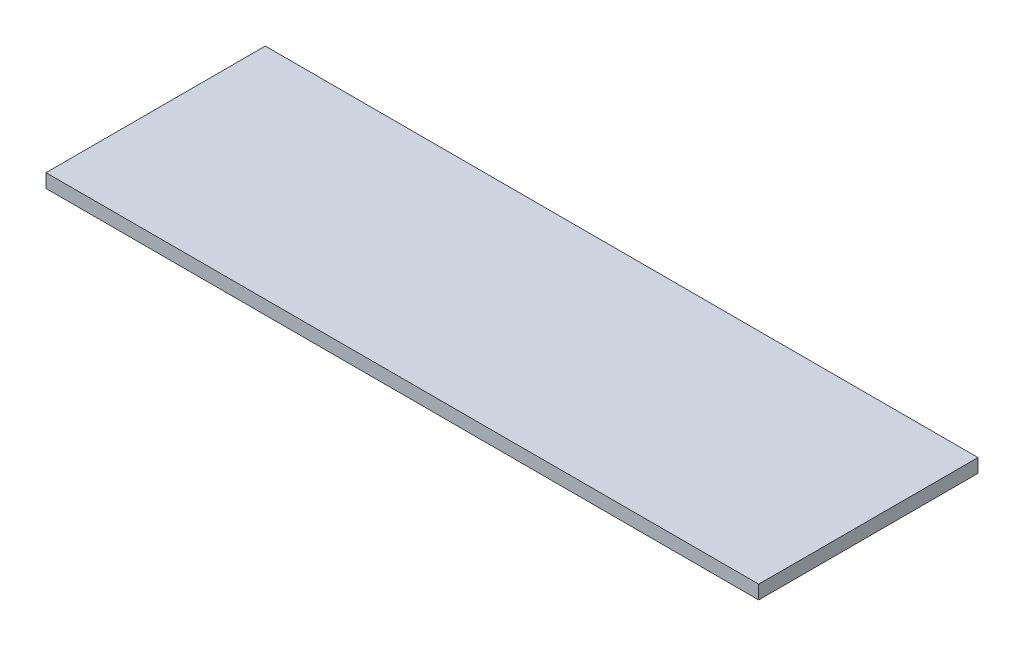
ISO-10303-21;
HEADER;
FILE_DESCRIPTION(('STEP AP214'),'2;1');
FILE_NAME('part.step','',(''),(''),'','','');
FILE_SCHEMA(('AUTOMOTIVE_DESIGN { 1 0 10303 214 1 1 1 1 }'));
ENDSEC;
DATA;
#1=APPLICATION_CONTEXT('core data for automotive mechanical design processes');
#2=APPLICATION_PROTOCOL_DEFINITION('international standard','automotive_design',2000,#1);
#3=PRODUCT_CONTEXT('',#1,'mechanical');
#4=PRODUCT('Part','Part','',(#3));
#5=PRODUCT_RELATED_PRODUCT_CATEGORY('part','',(#4));
#6=PRODUCT_DEFINITION_FORMATION('','',#4);
#7=PRODUCT_DEFINITION_CONTEXT('part definition',#1,'design');
#8=PRODUCT_DEFINITION('design','',#6,#7);
#9=PRODUCT_DEFINITION_SHAPE('','',#8);
#10=(LENGTH_UNIT() NAMED_UNIT(*) SI_UNIT(.MILLI.,.METRE.));
#11=(NAMED_UNIT(*) PLANE_ANGLE_UNIT() SI_UNIT($,.RADIAN.));
#12=(NAMED_UNIT(*) SI_UNIT($,.STERADIAN.) SOLID_ANGLE_UNIT());
#13=UNCERTAINTY_MEASURE_WITH_UNIT(LENGTH_MEASURE(1.E-05),#10,'distance_accuracy_value','');
#14=(GEOMETRIC_REPRESENTATION_CONTEXT(3) GLOBAL_UNCERTAINTY_ASSIGNED_CONTEXT((#13)) GLOBAL_UNIT_ASSIGNED_CONTEXT((#10,
#11,#12)) REPRESENTATION_CONTEXT('',''));
#15=CARTESIAN_POINT('',(0.,0.,0.));
#16=DIRECTION('',(0.,0.,1.));
#17=DIRECTION('',(1.,0.,0.));
#18=AXIS2_PLACEMENT_3D('',#15,#16,#17);
#19=CARTESIAN_POINT('',(-165.1,6.35,50.8));
#20=DIRECTION('',(1.,0.,0.));
#21=DIRECTION('',(0.,0.,-1.));
#22=AXIS2_PLACEMENT_3D('',#19,#20,#21);
#23=PLANE('',#22);
#24=DIRECTION('',(0.,0.,1.));
#25=VECTOR('',#24,1.);
#26=CARTESIAN_POINT('',(-165.1,0.,50.8));
#27=LINE('',#26,#25);
#28=CARTESIAN_POINT('',(-165.1,0.,-50.8));
#29=VERTEX_POINT('',#28);
#30=CARTESIAN_POINT('',(-165.1,0.,50.8));
#31=VERTEX_POINT('',#30);
#32=EDGE_CURVE('E97',#29,#31,#27,.T.);
#33=ORIENTED_EDGE('',*,*,#32,.T.);
#34=DIRECTION('',(0.,-1.,0.));
#35=VECTOR('',#34,1.);
#36=CARTESIAN_POINT('',(-165.1,6.35,50.8));
#37=LINE('',#36,#35);
#38=CARTESIAN_POINT('',(-165.1,6.35,50.8));
#39=VERTEX_POINT('',#38);
#40=EDGE_CURVE('E11',#39,#31,#37,.T.);
#41=ORIENTED_EDGE('',*,*,#40,.F.);
#42=DIRECTION('',(0.,0.,1.));
#43=VECTOR('',#42,1.);
#44=CARTESIAN_POINT('',(-165.1,6.35,50.8));
#45=LINE('',#44,#43);
#46=CARTESIAN_POINT('',(-165.1,6.35,-50.8));
#47=VERTEX_POINT('',#46);
#48=EDGE_CURVE('E85',#47,#39,#45,.T.);
#49=ORIENTED_EDGE('',*,*,#48,.F.);
#50=DIRECTION('',(0.,-1.,0.));
#51=VECTOR('',#50,1.);
#52=CARTESIAN_POINT('',(-165.1,6.35,-50.8));
#53=LINE('',#52,#51);
#54=EDGE_CURVE('E93',#47,#29,#53,.T.);
#55=ORIENTED_EDGE('',*,*,#54,.T.);
#56=EDGE_LOOP('',(#33,#41,#49,#55));
#57=FACE_BOUND('',#56,.T.);
#58=ADVANCED_FACE('F34',(#57),#23,.F.);
#59=CARTESIAN_POINT('',(165.1,6.35,50.8));
#60=DIRECTION('',(0.,0.,-1.));
#61=DIRECTION('',(-1.,0.,0.));
#62=AXIS2_PLACEMENT_3D('',#59,#60,#61);
#63=PLANE('',#62);
#64=DIRECTION('',(1.,0.,0.));
#65=VECTOR('',#64,1.);
#66=CARTESIAN_POINT('',(165.1,0.,50.8));
#67=LINE('',#66,#65);
#68=CARTESIAN_POINT('',(165.1,0.,50.8));
#69=VERTEX_POINT('',#68);
#70=EDGE_CURVE('E89',#31,#69,#67,.T.);
#71=ORIENTED_EDGE('',*,*,#70,.T.);
#72=DIRECTION('',(0.,-1.,0.));
#73=VECTOR('',#72,1.);
#74=CARTESIAN_POINT('',(165.1,6.35,50.8));
#75=LINE('',#74,#73);
#76=CARTESIAN_POINT('',(165.1,6.35,50.8));
#77=VERTEX_POINT('',#76);
#78=EDGE_CURVE('E42',#77,#69,#75,.T.);
#79=ORIENTED_EDGE('',*,*,#78,.F.);
#80=DIRECTION('',(1.,0.,0.));
#81=VECTOR('',#80,1.);
#82=CARTESIAN_POINT('',(165.1,6.35,50.8));
#83=LINE('',#82,#81);
#84=EDGE_CURVE('E80',#39,#77,#83,.T.);
#85=ORIENTED_EDGE('',*,*,#84,.F.);
#86=ORIENTED_EDGE('',*,*,#40,.T.);
#87=EDGE_LOOP('',(#71,#79,#85,#86));
#88=FACE_BOUND('',#87,.T.);
#89=ADVANCED_FACE('F88',(#88),#63,.F.);
#90=CARTESIAN_POINT('',(165.1,6.35,50.8));
#91=DIRECTION('',(-1.,0.,0.));
#92=DIRECTION('',(0.,0.,1.));
#93=AXIS2_PLACEMENT_3D('',#90,#91,#92);
#94=PLANE('',#93);
#95=DIRECTION('',(0.,0.,-1.));
#96=VECTOR('',#95,1.);
#97=CARTESIAN_POINT('',(165.1,0.,50.8));
#98=LINE('',#97,#96);
#99=CARTESIAN_POINT('',(165.1,0.,-50.8));
#100=VERTEX_POINT('',#99);
#101=EDGE_CURVE('E67',#69,#100,#98,.T.);
#102=ORIENTED_EDGE('',*,*,#101,.T.);
#103=DIRECTION('',(0.,-1.,0.));
#104=VECTOR('',#103,1.);
#105=CARTESIAN_POINT('',(165.1,6.35,-50.8));
#106=LINE('',#105,#104);
#107=CARTESIAN_POINT('',(165.1,6.35,-50.8));
#108=VERTEX_POINT('',#107);
#109=EDGE_CURVE('E90',#108,#100,#106,.T.);
#110=ORIENTED_EDGE('',*,*,#109,.F.);
#111=DIRECTION('',(0.,0.,-1.));
#112=VECTOR('',#111,1.);
#113=CARTESIAN_POINT('',(165.1,6.35,50.8));
#114=LINE('',#113,#112);
#115=EDGE_CURVE('E83',#77,#108,#114,.T.);
#116=ORIENTED_EDGE('',*,*,#115,.F.);
#117=ORIENTED_EDGE('',*,*,#78,.T.);
#118=EDGE_LOOP('',(#102,#110,#116,#117));
#119=FACE_BOUND('',#118,.T.);
#120=ADVANCED_FACE('F91',(#119),#94,.F.);
#121=CARTESIAN_POINT('',(165.1,6.35,-50.8));
#122=DIRECTION('',(0.,0.,1.));
#123=DIRECTION('',(1.,0.,0.));
#124=AXIS2_PLACEMENT_3D('',#121,#122,#123);
#125=PLANE('',#124);
#126=DIRECTION('',(-1.,0.,0.));
#127=VECTOR('',#126,1.);
#128=CARTESIAN_POINT('',(165.1,0.,-50.8));
#129=LINE('',#128,#127);
#130=EDGE_CURVE('E73',#100,#29,#129,.T.);
#131=ORIENTED_EDGE('',*,*,#130,.T.);
#132=ORIENTED_EDGE('',*,*,#54,.F.);
#133=DIRECTION('',(-1.,0.,0.));
#134=VECTOR('',#133,1.);
#135=CARTESIAN_POINT('',(165.1,6.35,-50.8));
#136=LINE('',#135,#134);
#137=EDGE_CURVE('E50',#108,#47,#136,.T.);
#138=ORIENTED_EDGE('',*,*,#137,.F.);
#139=ORIENTED_EDGE('',*,*,#109,.T.);
#140=EDGE_LOOP('',(#131,#132,#138,#139));
#141=FACE_BOUND('',#140,.T.);
#142=ADVANCED_FACE('F104',(#141),#125,.F.);
#143=CARTESIAN_POINT('',(0.,6.35,0.));
#144=DIRECTION('',(0.,1.,0.));
#145=DIRECTION('',(0.,0.,1.));
#146=AXIS2_PLACEMENT_3D('',#143,#144,#145);
#147=PLANE('',#146);
#148=ORIENTED_EDGE('',*,*,#48,.T.);
#149=ORIENTED_EDGE('',*,*,#84,.T.);
#150=ORIENTED_EDGE('',*,*,#115,.T.);
#151=ORIENTED_EDGE('',*,*,#137,.T.);
#152=EDGE_LOOP('',(#148,#149,#150,#151));
#153=FACE_BOUND('',#152,.T.);
#154=ADVANCED_FACE('F81',(#153),#147,.T.);
#155=CARTESIAN_POINT('',(0.,0.,0.));
#156=DIRECTION('',(0.,1.,0.));
#157=DIRECTION('',(0.,0.,1.));
#158=AXIS2_PLACEMENT_3D('',#155,#156,#157);
#159=PLANE('',#158);
#160=ORIENTED_EDGE('',*,*,#32,.F.);
#161=ORIENTED_EDGE('',*,*,#130,.F.);
#162=ORIENTED_EDGE('',*,*,#101,.F.);
#163=ORIENTED_EDGE('',*,*,#70,.F.);
#164=EDGE_LOOP('',(#160,#161,#162,#163));
#165=FACE_BOUND('',#164,.T.);
#166=ADVANCED_FACE('F107',(#165),#159,.F.);
#167=CLOSED_SHELL('',(#58,#89,#120,#142,#154,#166));
#168=MANIFOLD_SOLID_BREP('B2',#167);
#169=ADVANCED_BREP_SHAPE_REPRESENTATION('',(#18,#168),#14);
#170=SHAPE_DEFINITION_REPRESENTATION(#9,#169);
ENDSEC;
END-ISO-10303-21;
